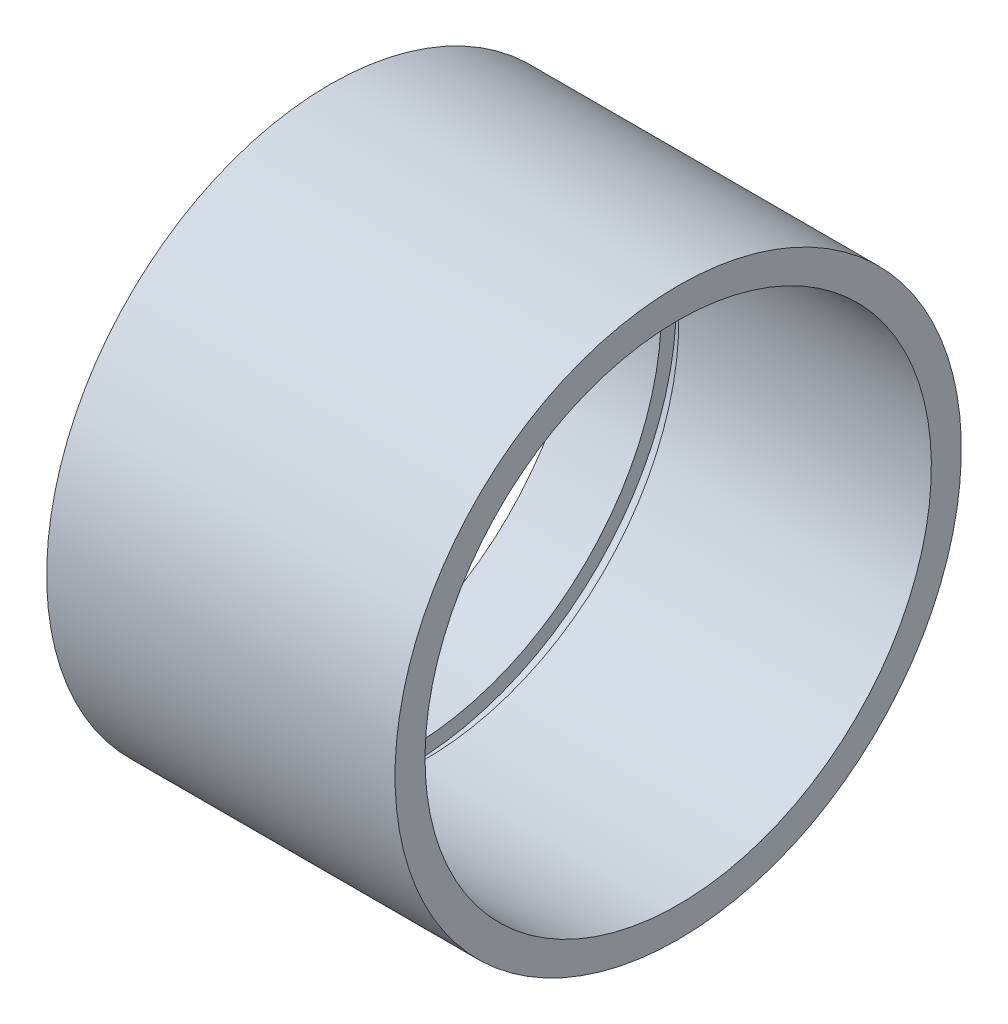
ISO-10303-21;
HEADER;
FILE_DESCRIPTION(('STEP AP214'),'2;1');
FILE_NAME('part.step','',(''),(''),'','','');
FILE_SCHEMA(('AUTOMOTIVE_DESIGN { 1 0 10303 214 1 1 1 1 }'));
ENDSEC;
DATA;
#1=APPLICATION_CONTEXT('core data for automotive mechanical design processes');
#2=APPLICATION_PROTOCOL_DEFINITION('international standard','automotive_design',2000,#1);
#3=PRODUCT_CONTEXT('',#1,'mechanical');
#4=PRODUCT('Part','Part','',(#3));
#5=PRODUCT_RELATED_PRODUCT_CATEGORY('part','',(#4));
#6=PRODUCT_DEFINITION_FORMATION('','',#4);
#7=PRODUCT_DEFINITION_CONTEXT('part definition',#1,'design');
#8=PRODUCT_DEFINITION('design','',#6,#7);
#9=PRODUCT_DEFINITION_SHAPE('','',#8);
#10=(LENGTH_UNIT() NAMED_UNIT(*) SI_UNIT(.MILLI.,.METRE.));
#11=(NAMED_UNIT(*) PLANE_ANGLE_UNIT() SI_UNIT($,.RADIAN.));
#12=(NAMED_UNIT(*) SI_UNIT($,.STERADIAN.) SOLID_ANGLE_UNIT());
#13=UNCERTAINTY_MEASURE_WITH_UNIT(LENGTH_MEASURE(1.E-05),#10,'distance_accuracy_value','');
#14=(GEOMETRIC_REPRESENTATION_CONTEXT(3) GLOBAL_UNCERTAINTY_ASSIGNED_CONTEXT((#13)) GLOBAL_UNIT_ASSIGNED_CONTEXT((#10,
#11,#12)) REPRESENTATION_CONTEXT('',''));
#15=CARTESIAN_POINT('',(0.,0.,0.));
#16=DIRECTION('',(0.,0.,1.));
#17=DIRECTION('',(1.,0.,0.));
#18=AXIS2_PLACEMENT_3D('',#15,#16,#17);
#19=CARTESIAN_POINT('',(33.7563399675845,-35.5092,0.));
#20=DIRECTION('',(-1.,0.,0.));
#21=DIRECTION('',(0.,-1.,0.));
#22=AXIS2_PLACEMENT_3D('',#19,#20,#21);
#23=PLANE('',#22);
#24=CARTESIAN_POINT('',(33.7563399675845,0.,0.));
#25=DIRECTION('',(1.,0.,0.));
#26=DIRECTION('',(0.,1.,0.));
#27=AXIS2_PLACEMENT_3D('',#24,#25,#26);
#28=CIRCLE('',#27,31.75);
#29=CARTESIAN_POINT('',(33.7563399675845,31.75,0.));
#30=VERTEX_POINT('',#29);
#31=EDGE_CURVE('E10',#30,#30,#28,.T.);
#32=ORIENTED_EDGE('',*,*,#31,.F.);
#33=EDGE_LOOP('',(#32));
#34=FACE_BOUND('',#33,.T.);
#35=CARTESIAN_POINT('',(33.7563399675845,0.,0.));
#36=DIRECTION('',(1.,0.,0.));
#37=DIRECTION('',(0.,1.,0.));
#38=AXIS2_PLACEMENT_3D('',#35,#36,#37);
#39=CIRCLE('',#38,35.5092);
#40=CARTESIAN_POINT('',(33.7563399675845,35.5092,0.));
#41=VERTEX_POINT('',#40);
#42=EDGE_CURVE('E60',#41,#41,#39,.T.);
#43=ORIENTED_EDGE('',*,*,#42,.T.);
#44=EDGE_LOOP('',(#43));
#45=FACE_BOUND('',#44,.T.);
#46=ADVANCED_FACE('F32',(#34,#45),#23,.F.);
#47=CARTESIAN_POINT('',(33.7563399675845,0.,0.));
#48=DIRECTION('',(1.,0.,0.));
#49=DIRECTION('',(0.,1.,0.));
#50=AXIS2_PLACEMENT_3D('',#47,#48,#49);
#51=CYLINDRICAL_SURFACE('',#50,31.75);
#52=CARTESIAN_POINT('',(2.08253996758449,0.,0.));
#53=DIRECTION('',(1.,0.,0.));
#54=DIRECTION('',(0.,1.,0.));
#55=AXIS2_PLACEMENT_3D('',#52,#53,#54);
#56=CIRCLE('',#55,31.75);
#57=CARTESIAN_POINT('',(2.08253996758449,31.75,0.));
#58=VERTEX_POINT('',#57);
#59=EDGE_CURVE('E38',#58,#58,#56,.T.);
#60=ORIENTED_EDGE('',*,*,#59,.F.);
#61=EDGE_LOOP('',(#60));
#62=FACE_BOUND('',#61,.T.);
#63=ORIENTED_EDGE('',*,*,#31,.T.);
#64=EDGE_LOOP('',(#63));
#65=FACE_BOUND('',#64,.T.);
#66=ADVANCED_FACE('F97',(#62,#65),#51,.F.);
#67=CARTESIAN_POINT('',(2.08253996758449,-31.75,0.));
#68=DIRECTION('',(1.,0.,0.));
#69=DIRECTION('',(0.,1.,0.));
#70=AXIS2_PLACEMENT_3D('',#67,#68,#69);
#71=PLANE('',#70);
#72=CARTESIAN_POINT('',(2.08253996758449,0.,0.));
#73=DIRECTION('',(1.,0.,0.));
#74=DIRECTION('',(0.,1.,0.));
#75=AXIS2_PLACEMENT_3D('',#72,#73,#74);
#76=CIRCLE('',#75,33.6296);
#77=CARTESIAN_POINT('',(2.08253996758449,33.6296,0.));
#78=VERTEX_POINT('',#77);
#79=EDGE_CURVE('E42',#78,#78,#76,.T.);
#80=ORIENTED_EDGE('',*,*,#79,.F.);
#81=EDGE_LOOP('',(#80));
#82=FACE_BOUND('',#81,.T.);
#83=ORIENTED_EDGE('',*,*,#59,.T.);
#84=EDGE_LOOP('',(#83));
#85=FACE_BOUND('',#84,.T.);
#86=ADVANCED_FACE('F92',(#82,#85),#71,.F.);
#87=CARTESIAN_POINT('',(33.7563399675845,0.,0.));
#88=DIRECTION('',(1.,0.,0.));
#89=DIRECTION('',(0.,1.,0.));
#90=AXIS2_PLACEMENT_3D('',#87,#88,#89);
#91=CYLINDRICAL_SURFACE('',#90,33.6296);
#92=CARTESIAN_POINT('',(-0.10186003241551,0.,0.));
#93=DIRECTION('',(1.,0.,0.));
#94=DIRECTION('',(0.,1.,0.));
#95=AXIS2_PLACEMENT_3D('',#92,#93,#94);
#96=CIRCLE('',#95,33.6296);
#97=CARTESIAN_POINT('',(-0.10186003241551,33.6296,0.));
#98=VERTEX_POINT('',#97);
#99=EDGE_CURVE('E46',#98,#98,#96,.T.);
#100=ORIENTED_EDGE('',*,*,#99,.F.);
#101=EDGE_LOOP('',(#100));
#102=FACE_BOUND('',#101,.T.);
#103=ORIENTED_EDGE('',*,*,#79,.T.);
#104=EDGE_LOOP('',(#103));
#105=FACE_BOUND('',#104,.T.);
#106=ADVANCED_FACE('F86',(#102,#105),#91,.F.);
#107=CARTESIAN_POINT('',(-0.101860032415511,-33.6296,0.));
#108=DIRECTION('',(-1.,0.,0.));
#109=DIRECTION('',(0.,-1.,0.));
#110=AXIS2_PLACEMENT_3D('',#107,#108,#109);
#111=PLANE('',#110);
#112=CARTESIAN_POINT('',(-0.10186003241551,0.,0.));
#113=DIRECTION('',(1.,0.,0.));
#114=DIRECTION('',(0.,1.,0.));
#115=AXIS2_PLACEMENT_3D('',#112,#113,#114);
#116=CIRCLE('',#115,31.75);
#117=CARTESIAN_POINT('',(-0.10186003241551,31.75,0.));
#118=VERTEX_POINT('',#117);
#119=EDGE_CURVE('E51',#118,#118,#116,.T.);
#120=ORIENTED_EDGE('',*,*,#119,.F.);
#121=EDGE_LOOP('',(#120));
#122=FACE_BOUND('',#121,.T.);
#123=ORIENTED_EDGE('',*,*,#99,.T.);
#124=EDGE_LOOP('',(#123));
#125=FACE_BOUND('',#124,.T.);
#126=ADVANCED_FACE('F80',(#122,#125),#111,.F.);
#127=CARTESIAN_POINT('',(33.7563399675845,0.,0.));
#128=DIRECTION('',(1.,0.,0.));
#129=DIRECTION('',(0.,1.,0.));
#130=AXIS2_PLACEMENT_3D('',#127,#128,#129);
#131=CYLINDRICAL_SURFACE('',#130,31.75);
#132=CARTESIAN_POINT('',(-9.93166003241552,0.,0.));
#133=DIRECTION('',(1.,0.,0.));
#134=DIRECTION('',(0.,1.,0.));
#135=AXIS2_PLACEMENT_3D('',#132,#133,#134);
#136=CIRCLE('',#135,31.75);
#137=CARTESIAN_POINT('',(-9.93166003241552,31.75,0.));
#138=VERTEX_POINT('',#137);
#139=EDGE_CURVE('E54',#138,#138,#136,.T.);
#140=ORIENTED_EDGE('',*,*,#139,.F.);
#141=EDGE_LOOP('',(#140));
#142=FACE_BOUND('',#141,.T.);
#143=ORIENTED_EDGE('',*,*,#119,.T.);
#144=EDGE_LOOP('',(#143));
#145=FACE_BOUND('',#144,.T.);
#146=ADVANCED_FACE('F74',(#142,#145),#131,.F.);
#147=CARTESIAN_POINT('',(-9.93166003241551,-31.75,0.));
#148=DIRECTION('',(1.,0.,0.));
#149=DIRECTION('',(0.,1.,0.));
#150=AXIS2_PLACEMENT_3D('',#147,#148,#149);
#151=PLANE('',#150);
#152=CARTESIAN_POINT('',(-9.93166003241552,0.,0.));
#153=DIRECTION('',(1.,0.,0.));
#154=DIRECTION('',(0.,1.,0.));
#155=AXIS2_PLACEMENT_3D('',#152,#153,#154);
#156=CIRCLE('',#155,35.5092);
#157=CARTESIAN_POINT('',(-9.93166003241552,35.5092,0.));
#158=VERTEX_POINT('',#157);
#159=EDGE_CURVE('E57',#158,#158,#156,.T.);
#160=ORIENTED_EDGE('',*,*,#159,.F.);
#161=EDGE_LOOP('',(#160));
#162=FACE_BOUND('',#161,.T.);
#163=ORIENTED_EDGE('',*,*,#139,.T.);
#164=EDGE_LOOP('',(#163));
#165=FACE_BOUND('',#164,.T.);
#166=ADVANCED_FACE('F68',(#162,#165),#151,.F.);
#167=CARTESIAN_POINT('',(33.7563399675845,0.,0.));
#168=DIRECTION('',(1.,0.,0.));
#169=DIRECTION('',(0.,1.,0.));
#170=AXIS2_PLACEMENT_3D('',#167,#168,#169);
#171=CYLINDRICAL_SURFACE('',#170,35.5092);
#172=ORIENTED_EDGE('',*,*,#42,.F.);
#173=EDGE_LOOP('',(#172));
#174=FACE_BOUND('',#173,.T.);
#175=ORIENTED_EDGE('',*,*,#159,.T.);
#176=EDGE_LOOP('',(#175));
#177=FACE_BOUND('',#176,.T.);
#178=ADVANCED_FACE('F65',(#174,#177),#171,.T.);
#179=CLOSED_SHELL('',(#46,#66,#86,#106,#126,#146,#166,#178));
#180=MANIFOLD_SOLID_BREP('B2',#179);
#181=ADVANCED_BREP_SHAPE_REPRESENTATION('',(#18,#180),#14);
#182=SHAPE_DEFINITION_REPRESENTATION(#9,#181);
ENDSEC;
END-ISO-10303-21;
